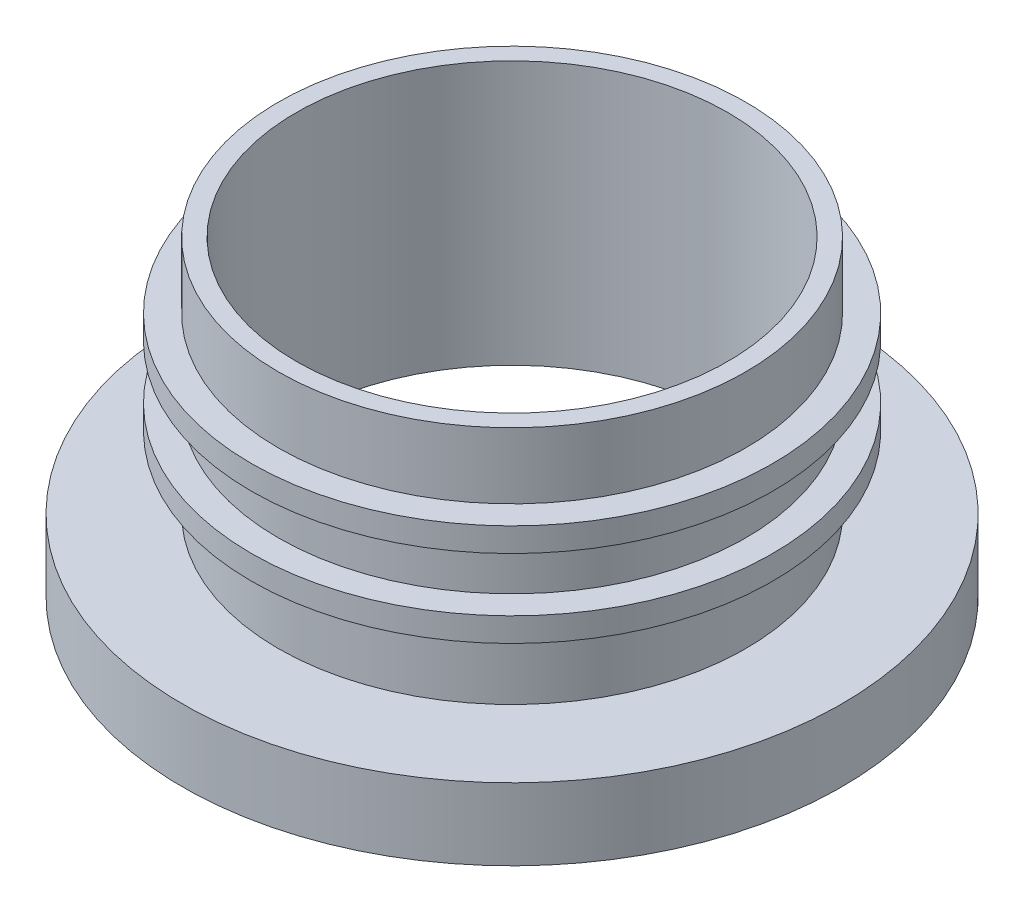
ISO-10303-21;
HEADER;
FILE_DESCRIPTION(('STEP AP214'),'2;1');
FILE_NAME('part.step','',(''),(''),'','','');
FILE_SCHEMA(('AUTOMOTIVE_DESIGN { 1 0 10303 214 1 1 1 1 }'));
ENDSEC;
DATA;
#1=APPLICATION_CONTEXT('core data for automotive mechanical design processes');
#2=APPLICATION_PROTOCOL_DEFINITION('international standard','automotive_design',2000,#1);
#3=PRODUCT_CONTEXT('',#1,'mechanical');
#4=PRODUCT('Part','Part','',(#3));
#5=PRODUCT_RELATED_PRODUCT_CATEGORY('part','',(#4));
#6=PRODUCT_DEFINITION_FORMATION('','',#4);
#7=PRODUCT_DEFINITION_CONTEXT('part definition',#1,'design');
#8=PRODUCT_DEFINITION('design','',#6,#7);
#9=PRODUCT_DEFINITION_SHAPE('','',#8);
#10=(LENGTH_UNIT() NAMED_UNIT(*) SI_UNIT(.MILLI.,.METRE.));
#11=(NAMED_UNIT(*) PLANE_ANGLE_UNIT() SI_UNIT($,.RADIAN.));
#12=(NAMED_UNIT(*) SI_UNIT($,.STERADIAN.) SOLID_ANGLE_UNIT());
#13=UNCERTAINTY_MEASURE_WITH_UNIT(LENGTH_MEASURE(1.E-05),#10,'distance_accuracy_value','');
#14=(GEOMETRIC_REPRESENTATION_CONTEXT(3) GLOBAL_UNCERTAINTY_ASSIGNED_CONTEXT((#13)) GLOBAL_UNIT_ASSIGNED_CONTEXT((#10,
#11,#12)) REPRESENTATION_CONTEXT('',''));
#15=CARTESIAN_POINT('',(0.,0.,0.));
#16=DIRECTION('',(0.,0.,1.));
#17=DIRECTION('',(1.,0.,0.));
#18=AXIS2_PLACEMENT_3D('',#15,#16,#17);
#19=CARTESIAN_POINT('',(0.,20.,0.));
#20=DIRECTION('',(0.,-1.,0.));
#21=DIRECTION('',(0.,0.,-1.));
#22=AXIS2_PLACEMENT_3D('',#19,#20,#21);
#23=CYLINDRICAL_SURFACE('',#22,19.5);
#24=CARTESIAN_POINT('',(0.,8.,0.));
#25=DIRECTION('',(0.,1.,0.));
#26=DIRECTION('',(0.,0.,1.));
#27=AXIS2_PLACEMENT_3D('',#24,#25,#26);
#28=CIRCLE('',#27,19.5);
#29=CARTESIAN_POINT('',(0.,8.,19.5));
#30=VERTEX_POINT('',#29);
#31=EDGE_CURVE('E64',#30,#30,#28,.T.);
#32=ORIENTED_EDGE('',*,*,#31,.T.);
#33=EDGE_LOOP('',(#32));
#34=FACE_BOUND('',#33,.T.);
#35=CARTESIAN_POINT('',(0.,12.5,0.));
#36=DIRECTION('',(0.,1.,0.));
#37=DIRECTION('',(0.,0.,1.));
#38=AXIS2_PLACEMENT_3D('',#35,#36,#37);
#39=CIRCLE('',#38,19.5);
#40=CARTESIAN_POINT('',(0.,12.5,19.5));
#41=VERTEX_POINT('',#40);
#42=EDGE_CURVE('E41',#41,#41,#39,.T.);
#43=ORIENTED_EDGE('',*,*,#42,.F.);
#44=EDGE_LOOP('',(#43));
#45=FACE_BOUND('',#44,.T.);
#46=ADVANCED_FACE('F34',(#34,#45),#23,.T.);
#47=CARTESIAN_POINT('',(0.,0.,0.));
#48=DIRECTION('',(0.,1.,0.));
#49=DIRECTION('',(0.,0.,1.));
#50=AXIS2_PLACEMENT_3D('',#47,#48,#49);
#51=CIRCLE('',#50,19.5);
#52=CARTESIAN_POINT('',(0.,0.,19.5));
#53=VERTEX_POINT('',#52);
#54=EDGE_CURVE('E72',#53,#53,#51,.T.);
#55=ORIENTED_EDGE('',*,*,#54,.T.);
#56=EDGE_LOOP('',(#55));
#57=FACE_BOUND('',#56,.T.);
#58=CARTESIAN_POINT('',(0.,6.,0.));
#59=DIRECTION('',(0.,1.,0.));
#60=DIRECTION('',(0.,0.,1.));
#61=AXIS2_PLACEMENT_3D('',#58,#59,#60);
#62=CIRCLE('',#61,19.5);
#63=CARTESIAN_POINT('',(0.,6.,19.5));
#64=VERTEX_POINT('',#63);
#65=EDGE_CURVE('E45',#64,#64,#62,.T.);
#66=ORIENTED_EDGE('',*,*,#65,.F.);
#67=EDGE_LOOP('',(#66));
#68=FACE_BOUND('',#67,.T.);
#69=ADVANCED_FACE('F80',(#57,#68),#23,.T.);
#70=CARTESIAN_POINT('',(0.,-2.,0.));
#71=DIRECTION('',(0.,1.,0.));
#72=DIRECTION('',(0.,0.,1.));
#73=AXIS2_PLACEMENT_3D('',#70,#71,#72);
#74=CYLINDRICAL_SURFACE('',#73,27.5);
#75=CARTESIAN_POINT('',(0.,0.,0.));
#76=DIRECTION('',(0.,-1.,0.));
#77=DIRECTION('',(0.,0.,-1.));
#78=AXIS2_PLACEMENT_3D('',#75,#76,#77);
#79=CIRCLE('',#78,27.5);
#80=CARTESIAN_POINT('',(0.,0.,-27.5));
#81=VERTEX_POINT('',#80);
#82=EDGE_CURVE('E68',#81,#81,#79,.T.);
#83=ORIENTED_EDGE('',*,*,#82,.T.);
#84=EDGE_LOOP('',(#83));
#85=FACE_BOUND('',#84,.T.);
#86=CARTESIAN_POINT('',(0.,-6.,0.));
#87=DIRECTION('',(0.,-1.,0.));
#88=DIRECTION('',(0.,0.,-1.));
#89=AXIS2_PLACEMENT_3D('',#86,#87,#88);
#90=CIRCLE('',#89,27.5);
#91=CARTESIAN_POINT('',(0.,-6.,-27.5));
#92=VERTEX_POINT('',#91);
#93=EDGE_CURVE('E96',#92,#92,#90,.T.);
#94=ORIENTED_EDGE('',*,*,#93,.F.);
#95=EDGE_LOOP('',(#94));
#96=FACE_BOUND('',#95,.T.);
#97=ADVANCED_FACE('F87',(#85,#96),#74,.T.);
#98=CARTESIAN_POINT('',(0.,0.,0.));
#99=DIRECTION('',(0.,-1.,0.));
#100=DIRECTION('',(0.,0.,-1.));
#101=AXIS2_PLACEMENT_3D('',#98,#99,#100);
#102=PLANE('',#101);
#103=ORIENTED_EDGE('',*,*,#54,.F.);
#104=EDGE_LOOP('',(#103));
#105=FACE_BOUND('',#104,.T.);
#106=ORIENTED_EDGE('',*,*,#82,.F.);
#107=EDGE_LOOP('',(#106));
#108=FACE_BOUND('',#107,.T.);
#109=ADVANCED_FACE('F83',(#105,#108),#102,.F.);
#110=CARTESIAN_POINT('',(0.,6.,0.));
#111=DIRECTION('',(0.,1.,0.));
#112=DIRECTION('',(0.,0.,1.));
#113=AXIS2_PLACEMENT_3D('',#110,#111,#112);
#114=CYLINDRICAL_SURFACE('',#113,21.75);
#115=CARTESIAN_POINT('',(0.,6.,0.));
#116=DIRECTION('',(0.,1.,0.));
#117=DIRECTION('',(0.,0.,1.));
#118=AXIS2_PLACEMENT_3D('',#115,#116,#117);
#119=CIRCLE('',#118,21.75);
#120=CARTESIAN_POINT('',(0.,6.,21.75));
#121=VERTEX_POINT('',#120);
#122=EDGE_CURVE('E61',#121,#121,#119,.T.);
#123=ORIENTED_EDGE('',*,*,#122,.T.);
#124=EDGE_LOOP('',(#123));
#125=FACE_BOUND('',#124,.T.);
#126=CARTESIAN_POINT('',(0.,8.,0.));
#127=DIRECTION('',(0.,1.,0.));
#128=DIRECTION('',(0.,0.,1.));
#129=AXIS2_PLACEMENT_3D('',#126,#127,#128);
#130=CIRCLE('',#129,21.75);
#131=CARTESIAN_POINT('',(0.,8.,21.75));
#132=VERTEX_POINT('',#131);
#133=EDGE_CURVE('E59',#132,#132,#130,.T.);
#134=ORIENTED_EDGE('',*,*,#133,.F.);
#135=EDGE_LOOP('',(#134));
#136=FACE_BOUND('',#135,.T.);
#137=ADVANCED_FACE('F86',(#125,#136),#114,.T.);
#138=CARTESIAN_POINT('',(0.,6.,0.));
#139=DIRECTION('',(0.,1.,0.));
#140=DIRECTION('',(0.,0.,1.));
#141=AXIS2_PLACEMENT_3D('',#138,#139,#140);
#142=PLANE('',#141);
#143=ORIENTED_EDGE('',*,*,#65,.T.);
#144=EDGE_LOOP('',(#143));
#145=FACE_BOUND('',#144,.T.);
#146=ORIENTED_EDGE('',*,*,#122,.F.);
#147=EDGE_LOOP('',(#146));
#148=FACE_BOUND('',#147,.T.);
#149=ADVANCED_FACE('F138',(#145,#148),#142,.F.);
#150=CARTESIAN_POINT('',(0.,8.,0.));
#151=DIRECTION('',(0.,1.,0.));
#152=DIRECTION('',(0.,0.,1.));
#153=AXIS2_PLACEMENT_3D('',#150,#151,#152);
#154=PLANE('',#153);
#155=ORIENTED_EDGE('',*,*,#31,.F.);
#156=EDGE_LOOP('',(#155));
#157=FACE_BOUND('',#156,.T.);
#158=ORIENTED_EDGE('',*,*,#133,.T.);
#159=EDGE_LOOP('',(#158));
#160=FACE_BOUND('',#159,.T.);
#161=ADVANCED_FACE('F113',(#157,#160),#154,.T.);
#162=CARTESIAN_POINT('',(0.,14.5,0.));
#163=DIRECTION('',(0.,-1.,0.));
#164=DIRECTION('',(0.,0.,-1.));
#165=AXIS2_PLACEMENT_3D('',#162,#163,#164);
#166=CYLINDRICAL_SURFACE('',#165,21.75);
#167=CARTESIAN_POINT('',(0.,14.5,0.));
#168=DIRECTION('',(0.,1.,0.));
#169=DIRECTION('',(0.,0.,1.));
#170=AXIS2_PLACEMENT_3D('',#167,#168,#169);
#171=CIRCLE('',#170,21.75);
#172=CARTESIAN_POINT('',(0.,14.5,21.75));
#173=VERTEX_POINT('',#172);
#174=EDGE_CURVE('E60',#173,#173,#171,.T.);
#175=ORIENTED_EDGE('',*,*,#174,.F.);
#176=EDGE_LOOP('',(#175));
#177=FACE_BOUND('',#176,.T.);
#178=CARTESIAN_POINT('',(0.,12.5,0.));
#179=DIRECTION('',(0.,1.,0.));
#180=DIRECTION('',(0.,0.,1.));
#181=AXIS2_PLACEMENT_3D('',#178,#179,#180);
#182=CIRCLE('',#181,21.75);
#183=CARTESIAN_POINT('',(0.,12.5,21.75));
#184=VERTEX_POINT('',#183);
#185=EDGE_CURVE('E54',#184,#184,#182,.T.);
#186=ORIENTED_EDGE('',*,*,#185,.T.);
#187=EDGE_LOOP('',(#186));
#188=FACE_BOUND('',#187,.T.);
#189=ADVANCED_FACE('F110',(#177,#188),#166,.T.);
#190=CARTESIAN_POINT('',(0.,14.5,0.));
#191=DIRECTION('',(0.,1.,0.));
#192=DIRECTION('',(0.,0.,1.));
#193=AXIS2_PLACEMENT_3D('',#190,#191,#192);
#194=PLANE('',#193);
#195=CARTESIAN_POINT('',(0.,14.5,0.));
#196=DIRECTION('',(0.,1.,0.));
#197=DIRECTION('',(0.,0.,1.));
#198=AXIS2_PLACEMENT_3D('',#195,#196,#197);
#199=CIRCLE('',#198,19.5);
#200=CARTESIAN_POINT('',(0.,14.5,19.5));
#201=VERTEX_POINT('',#200);
#202=EDGE_CURVE('E56',#201,#201,#199,.T.);
#203=ORIENTED_EDGE('',*,*,#202,.F.);
#204=EDGE_LOOP('',(#203));
#205=FACE_BOUND('',#204,.T.);
#206=ORIENTED_EDGE('',*,*,#174,.T.);
#207=EDGE_LOOP('',(#206));
#208=FACE_BOUND('',#207,.T.);
#209=ADVANCED_FACE('F108',(#205,#208),#194,.T.);
#210=CARTESIAN_POINT('',(0.,12.5,0.));
#211=DIRECTION('',(0.,1.,0.));
#212=DIRECTION('',(0.,0.,1.));
#213=AXIS2_PLACEMENT_3D('',#210,#211,#212);
#214=PLANE('',#213);
#215=ORIENTED_EDGE('',*,*,#42,.T.);
#216=EDGE_LOOP('',(#215));
#217=FACE_BOUND('',#216,.T.);
#218=ORIENTED_EDGE('',*,*,#185,.F.);
#219=EDGE_LOOP('',(#218));
#220=FACE_BOUND('',#219,.T.);
#221=ADVANCED_FACE('F117',(#217,#220),#214,.F.);
#222=ORIENTED_EDGE('',*,*,#202,.T.);
#223=EDGE_LOOP('',(#222));
#224=FACE_BOUND('',#223,.T.);
#225=CARTESIAN_POINT('',(0.,20.,0.));
#226=DIRECTION('',(0.,1.,0.));
#227=DIRECTION('',(0.,0.,1.));
#228=AXIS2_PLACEMENT_3D('',#225,#226,#227);
#229=CIRCLE('',#228,19.5);
#230=CARTESIAN_POINT('',(0.,20.,19.5));
#231=VERTEX_POINT('',#230);
#232=EDGE_CURVE('E50',#231,#231,#229,.T.);
#233=ORIENTED_EDGE('',*,*,#232,.F.);
#234=EDGE_LOOP('',(#233));
#235=FACE_BOUND('',#234,.T.);
#236=ADVANCED_FACE('F36',(#224,#235),#23,.T.);
#237=CARTESIAN_POINT('',(0.,20.,0.));
#238=DIRECTION('',(0.,1.,0.));
#239=DIRECTION('',(0.,0.,1.));
#240=AXIS2_PLACEMENT_3D('',#237,#238,#239);
#241=PLANE('',#240);
#242=ORIENTED_EDGE('',*,*,#232,.T.);
#243=EDGE_LOOP('',(#242));
#244=FACE_BOUND('',#243,.T.);
#245=CARTESIAN_POINT('',(0.,20.,0.));
#246=DIRECTION('',(0.,1.,0.));
#247=DIRECTION('',(0.,0.,1.));
#248=AXIS2_PLACEMENT_3D('',#245,#246,#247);
#249=CIRCLE('',#248,18.);
#250=CARTESIAN_POINT('',(0.,20.,18.));
#251=VERTEX_POINT('',#250);
#252=EDGE_CURVE('E73',#251,#251,#249,.T.);
#253=ORIENTED_EDGE('',*,*,#252,.F.);
#254=EDGE_LOOP('',(#253));
#255=FACE_BOUND('',#254,.T.);
#256=ADVANCED_FACE('F124',(#244,#255),#241,.T.);
#257=CARTESIAN_POINT('',(0.,20.,0.));
#258=DIRECTION('',(0.,-1.,0.));
#259=DIRECTION('',(0.,0.,-1.));
#260=AXIS2_PLACEMENT_3D('',#257,#258,#259);
#261=CYLINDRICAL_SURFACE('',#260,18.);
#262=ORIENTED_EDGE('',*,*,#252,.T.);
#263=EDGE_LOOP('',(#262));
#264=FACE_BOUND('',#263,.T.);
#265=CARTESIAN_POINT('',(0.,-2.,0.));
#266=DIRECTION('',(0.,-1.,0.));
#267=DIRECTION('',(0.,0.,-1.));
#268=AXIS2_PLACEMENT_3D('',#265,#266,#267);
#269=CIRCLE('',#268,18.);
#270=CARTESIAN_POINT('',(0.,-2.,-18.));
#271=VERTEX_POINT('',#270);
#272=EDGE_CURVE('E102',#271,#271,#269,.T.);
#273=ORIENTED_EDGE('',*,*,#272,.T.);
#274=EDGE_LOOP('',(#273));
#275=FACE_BOUND('',#274,.T.);
#276=ADVANCED_FACE('F156',(#264,#275),#261,.F.);
#277=CARTESIAN_POINT('',(0.,-6.,0.));
#278=DIRECTION('',(0.,1.,0.));
#279=DIRECTION('',(0.,0.,1.));
#280=AXIS2_PLACEMENT_3D('',#277,#278,#279);
#281=CYLINDRICAL_SURFACE('',#280,25.);
#282=CARTESIAN_POINT('',(0.,-6.,0.));
#283=DIRECTION('',(0.,-1.,0.));
#284=DIRECTION('',(0.,0.,-1.));
#285=AXIS2_PLACEMENT_3D('',#282,#283,#284);
#286=CIRCLE('',#285,25.);
#287=CARTESIAN_POINT('',(0.,-6.,-25.));
#288=VERTEX_POINT('',#287);
#289=EDGE_CURVE('E98',#288,#288,#286,.T.);
#290=ORIENTED_EDGE('',*,*,#289,.T.);
#291=EDGE_LOOP('',(#290));
#292=FACE_BOUND('',#291,.T.);
#293=CARTESIAN_POINT('',(0.,-2.,0.));
#294=DIRECTION('',(0.,-1.,0.));
#295=DIRECTION('',(0.,0.,-1.));
#296=AXIS2_PLACEMENT_3D('',#293,#294,#295);
#297=CIRCLE('',#296,25.);
#298=CARTESIAN_POINT('',(0.,-2.,-25.));
#299=VERTEX_POINT('',#298);
#300=EDGE_CURVE('E10',#299,#299,#297,.F.);
#301=ORIENTED_EDGE('',*,*,#300,.T.);
#302=EDGE_LOOP('',(#301));
#303=FACE_BOUND('',#302,.T.);
#304=ADVANCED_FACE('F158',(#292,#303),#281,.F.);
#305=CARTESIAN_POINT('',(0.,-6.,0.));
#306=DIRECTION('',(0.,-1.,0.));
#307=DIRECTION('',(0.,0.,-1.));
#308=AXIS2_PLACEMENT_3D('',#305,#306,#307);
#309=PLANE('',#308);
#310=ORIENTED_EDGE('',*,*,#289,.F.);
#311=EDGE_LOOP('',(#310));
#312=FACE_BOUND('',#311,.T.);
#313=ORIENTED_EDGE('',*,*,#93,.T.);
#314=EDGE_LOOP('',(#313));
#315=FACE_BOUND('',#314,.T.);
#316=ADVANCED_FACE('F153',(#312,#315),#309,.T.);
#317=CARTESIAN_POINT('',(0.,-2.,0.));
#318=DIRECTION('',(0.,-1.,0.));
#319=DIRECTION('',(0.,0.,-1.));
#320=AXIS2_PLACEMENT_3D('',#317,#318,#319);
#321=PLANE('',#320);
#322=ORIENTED_EDGE('',*,*,#272,.F.);
#323=EDGE_LOOP('',(#322));
#324=FACE_BOUND('',#323,.T.);
#325=ORIENTED_EDGE('',*,*,#300,.F.);
#326=EDGE_LOOP('',(#325));
#327=FACE_BOUND('',#326,.T.);
#328=ADVANCED_FACE('F151',(#324,#327),#321,.T.);
#329=CLOSED_SHELL('',(#46,#69,#97,#109,#137,#149,#161,#189,#209,#221,#236,#256,#276,#304,#316,#328));
#330=MANIFOLD_SOLID_BREP('B2',#329);
#331=ADVANCED_BREP_SHAPE_REPRESENTATION('',(#18,#330),#14);
#332=SHAPE_DEFINITION_REPRESENTATION(#9,#331);
ENDSEC;
END-ISO-10303-21;
